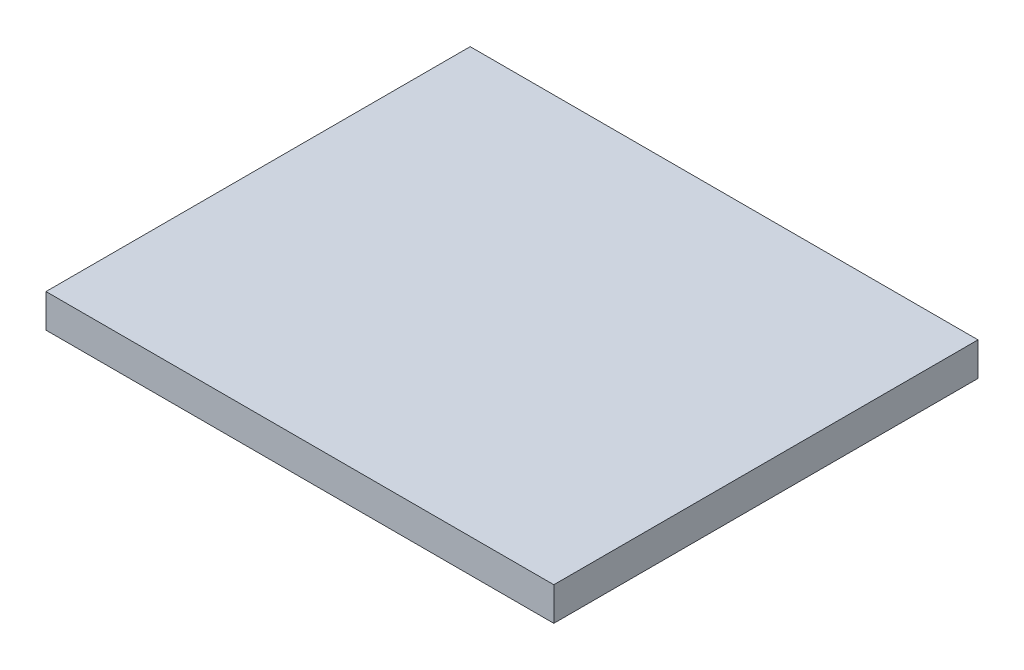
ISO-10303-21;
HEADER;
FILE_DESCRIPTION(('STEP AP214'),'2;1');
FILE_NAME('part.step','',(''),(''),'','','');
FILE_SCHEMA(('AUTOMOTIVE_DESIGN { 1 0 10303 214 1 1 1 1 }'));
ENDSEC;
DATA;
#1=APPLICATION_CONTEXT('core data for automotive mechanical design processes');
#2=APPLICATION_PROTOCOL_DEFINITION('international standard','automotive_design',2000,#1);
#3=PRODUCT_CONTEXT('',#1,'mechanical');
#4=PRODUCT('Part','Part','',(#3));
#5=PRODUCT_RELATED_PRODUCT_CATEGORY('part','',(#4));
#6=PRODUCT_DEFINITION_FORMATION('','',#4);
#7=PRODUCT_DEFINITION_CONTEXT('part definition',#1,'design');
#8=PRODUCT_DEFINITION('design','',#6,#7);
#9=PRODUCT_DEFINITION_SHAPE('','',#8);
#10=(LENGTH_UNIT() NAMED_UNIT(*) SI_UNIT(.MILLI.,.METRE.));
#11=(NAMED_UNIT(*) PLANE_ANGLE_UNIT() SI_UNIT($,.RADIAN.));
#12=(NAMED_UNIT(*) SI_UNIT($,.STERADIAN.) SOLID_ANGLE_UNIT());
#13=UNCERTAINTY_MEASURE_WITH_UNIT(LENGTH_MEASURE(1.E-05),#10,'distance_accuracy_value','');
#14=(GEOMETRIC_REPRESENTATION_CONTEXT(3) GLOBAL_UNCERTAINTY_ASSIGNED_CONTEXT((#13)) GLOBAL_UNIT_ASSIGNED_CONTEXT((#10,
#11,#12)) REPRESENTATION_CONTEXT('',''));
#15=CARTESIAN_POINT('',(0.,0.,0.));
#16=DIRECTION('',(0.,0.,1.));
#17=DIRECTION('',(1.,0.,0.));
#18=AXIS2_PLACEMENT_3D('',#15,#16,#17);
#19=CARTESIAN_POINT('',(-10.140928618744,0.56,-2.64164705149988));
#20=DIRECTION('',(1.,0.,0.));
#21=DIRECTION('',(0.,0.,-1.));
#22=AXIS2_PLACEMENT_3D('',#19,#20,#21);
#23=PLANE('',#22);
#24=DIRECTION('',(0.,0.,1.));
#25=VECTOR('',#24,1.);
#26=CARTESIAN_POINT('',(-10.140928618744,0.,-2.64164705149988));
#27=LINE('',#26,#25);
#28=CARTESIAN_POINT('',(-10.140928618744,0.,-2.64164705149988));
#29=VERTEX_POINT('',#28);
#30=CARTESIAN_POINT('',(-10.140928618744,0.,4.45835294850012));
#31=VERTEX_POINT('',#30);
#32=EDGE_CURVE('E98',#29,#31,#27,.T.);
#33=ORIENTED_EDGE('',*,*,#32,.T.);
#34=DIRECTION('',(0.,-1.,0.));
#35=VECTOR('',#34,1.);
#36=CARTESIAN_POINT('',(-10.140928618744,0.56,4.45835294850012));
#37=LINE('',#36,#35);
#38=CARTESIAN_POINT('',(-10.140928618744,0.56,4.45835294850012));
#39=VERTEX_POINT('',#38);
#40=EDGE_CURVE('E11',#39,#31,#37,.T.);
#41=ORIENTED_EDGE('',*,*,#40,.F.);
#42=DIRECTION('',(0.,0.,1.));
#43=VECTOR('',#42,1.);
#44=CARTESIAN_POINT('',(-10.140928618744,0.56,-2.64164705149988));
#45=LINE('',#44,#43);
#46=CARTESIAN_POINT('',(-10.140928618744,0.56,-2.64164705149988));
#47=VERTEX_POINT('',#46);
#48=EDGE_CURVE('E86',#47,#39,#45,.T.);
#49=ORIENTED_EDGE('',*,*,#48,.F.);
#50=DIRECTION('',(0.,-1.,0.));
#51=VECTOR('',#50,1.);
#52=CARTESIAN_POINT('',(-10.140928618744,0.56,-2.64164705149988));
#53=LINE('',#52,#51);
#54=EDGE_CURVE('E94',#47,#29,#53,.T.);
#55=ORIENTED_EDGE('',*,*,#54,.T.);
#56=EDGE_LOOP('',(#33,#41,#49,#55));
#57=FACE_BOUND('',#56,.T.);
#58=ADVANCED_FACE('F35',(#57),#23,.F.);
#59=CARTESIAN_POINT('',(-10.140928618744,0.56,4.45835294850012));
#60=DIRECTION('',(0.,0.,-1.));
#61=DIRECTION('',(-1.,0.,0.));
#62=AXIS2_PLACEMENT_3D('',#59,#60,#61);
#63=PLANE('',#62);
#64=DIRECTION('',(1.,0.,0.));
#65=VECTOR('',#64,1.);
#66=CARTESIAN_POINT('',(-10.140928618744,0.,4.45835294850012));
#67=LINE('',#66,#65);
#68=CARTESIAN_POINT('',(-1.64092861874402,0.,4.45835294850012));
#69=VERTEX_POINT('',#68);
#70=EDGE_CURVE('E90',#31,#69,#67,.T.);
#71=ORIENTED_EDGE('',*,*,#70,.T.);
#72=DIRECTION('',(0.,-1.,0.));
#73=VECTOR('',#72,1.);
#74=CARTESIAN_POINT('',(-1.64092861874402,0.56,4.45835294850012));
#75=LINE('',#74,#73);
#76=CARTESIAN_POINT('',(-1.64092861874402,0.56,4.45835294850012));
#77=VERTEX_POINT('',#76);
#78=EDGE_CURVE('E43',#77,#69,#75,.T.);
#79=ORIENTED_EDGE('',*,*,#78,.F.);
#80=DIRECTION('',(1.,0.,0.));
#81=VECTOR('',#80,1.);
#82=CARTESIAN_POINT('',(-10.140928618744,0.56,4.45835294850012));
#83=LINE('',#82,#81);
#84=EDGE_CURVE('E81',#39,#77,#83,.T.);
#85=ORIENTED_EDGE('',*,*,#84,.F.);
#86=ORIENTED_EDGE('',*,*,#40,.T.);
#87=EDGE_LOOP('',(#71,#79,#85,#86));
#88=FACE_BOUND('',#87,.T.);
#89=ADVANCED_FACE('F89',(#88),#63,.F.);
#90=CARTESIAN_POINT('',(-1.64092861874402,0.56,-2.64164705149988));
#91=DIRECTION('',(-1.,0.,0.));
#92=DIRECTION('',(0.,0.,1.));
#93=AXIS2_PLACEMENT_3D('',#90,#91,#92);
#94=PLANE('',#93);
#95=DIRECTION('',(0.,0.,-1.));
#96=VECTOR('',#95,1.);
#97=CARTESIAN_POINT('',(-1.64092861874402,0.,-2.64164705149988));
#98=LINE('',#97,#96);
#99=CARTESIAN_POINT('',(-1.64092861874402,0.,-2.64164705149988));
#100=VERTEX_POINT('',#99);
#101=EDGE_CURVE('E68',#69,#100,#98,.T.);
#102=ORIENTED_EDGE('',*,*,#101,.T.);
#103=DIRECTION('',(0.,-1.,0.));
#104=VECTOR('',#103,1.);
#105=CARTESIAN_POINT('',(-1.64092861874402,0.56,-2.64164705149988));
#106=LINE('',#105,#104);
#107=CARTESIAN_POINT('',(-1.64092861874402,0.56,-2.64164705149988));
#108=VERTEX_POINT('',#107);
#109=EDGE_CURVE('E91',#108,#100,#106,.T.);
#110=ORIENTED_EDGE('',*,*,#109,.F.);
#111=DIRECTION('',(0.,0.,-1.));
#112=VECTOR('',#111,1.);
#113=CARTESIAN_POINT('',(-1.64092861874402,0.56,-2.64164705149988));
#114=LINE('',#113,#112);
#115=EDGE_CURVE('E84',#77,#108,#114,.T.);
#116=ORIENTED_EDGE('',*,*,#115,.F.);
#117=ORIENTED_EDGE('',*,*,#78,.T.);
#118=EDGE_LOOP('',(#102,#110,#116,#117));
#119=FACE_BOUND('',#118,.T.);
#120=ADVANCED_FACE('F92',(#119),#94,.F.);
#121=CARTESIAN_POINT('',(-10.140928618744,0.56,-2.64164705149988));
#122=DIRECTION('',(0.,0.,1.));
#123=DIRECTION('',(1.,0.,0.));
#124=AXIS2_PLACEMENT_3D('',#121,#122,#123);
#125=PLANE('',#124);
#126=DIRECTION('',(-1.,0.,0.));
#127=VECTOR('',#126,1.);
#128=CARTESIAN_POINT('',(-10.140928618744,0.,-2.64164705149988));
#129=LINE('',#128,#127);
#130=EDGE_CURVE('E74',#100,#29,#129,.T.);
#131=ORIENTED_EDGE('',*,*,#130,.T.);
#132=ORIENTED_EDGE('',*,*,#54,.F.);
#133=DIRECTION('',(-1.,0.,0.));
#134=VECTOR('',#133,1.);
#135=CARTESIAN_POINT('',(-10.140928618744,0.56,-2.64164705149988));
#136=LINE('',#135,#134);
#137=EDGE_CURVE('E51',#108,#47,#136,.T.);
#138=ORIENTED_EDGE('',*,*,#137,.F.);
#139=ORIENTED_EDGE('',*,*,#109,.T.);
#140=EDGE_LOOP('',(#131,#132,#138,#139));
#141=FACE_BOUND('',#140,.T.);
#142=ADVANCED_FACE('F105',(#141),#125,.F.);
#143=CARTESIAN_POINT('',(0.,0.56,0.));
#144=DIRECTION('',(0.,1.,0.));
#145=DIRECTION('',(0.,0.,1.));
#146=AXIS2_PLACEMENT_3D('',#143,#144,#145);
#147=PLANE('',#146);
#148=ORIENTED_EDGE('',*,*,#48,.T.);
#149=ORIENTED_EDGE('',*,*,#84,.T.);
#150=ORIENTED_EDGE('',*,*,#115,.T.);
#151=ORIENTED_EDGE('',*,*,#137,.T.);
#152=EDGE_LOOP('',(#148,#149,#150,#151));
#153=FACE_BOUND('',#152,.T.);
#154=ADVANCED_FACE('F82',(#153),#147,.T.);
#155=CARTESIAN_POINT('',(0.,0.,0.));
#156=DIRECTION('',(0.,1.,0.));
#157=DIRECTION('',(0.,0.,1.));
#158=AXIS2_PLACEMENT_3D('',#155,#156,#157);
#159=PLANE('',#158);
#160=ORIENTED_EDGE('',*,*,#32,.F.);
#161=ORIENTED_EDGE('',*,*,#130,.F.);
#162=ORIENTED_EDGE('',*,*,#101,.F.);
#163=ORIENTED_EDGE('',*,*,#70,.F.);
#164=EDGE_LOOP('',(#160,#161,#162,#163));
#165=FACE_BOUND('',#164,.T.);
#166=ADVANCED_FACE('F108',(#165),#159,.F.);
#167=CLOSED_SHELL('',(#58,#89,#120,#142,#154,#166));
#168=MANIFOLD_SOLID_BREP('B2',#167);
#169=ADVANCED_BREP_SHAPE_REPRESENTATION('',(#18,#168),#14);
#170=SHAPE_DEFINITION_REPRESENTATION(#9,#169);
ENDSEC;
END-ISO-10303-21;
